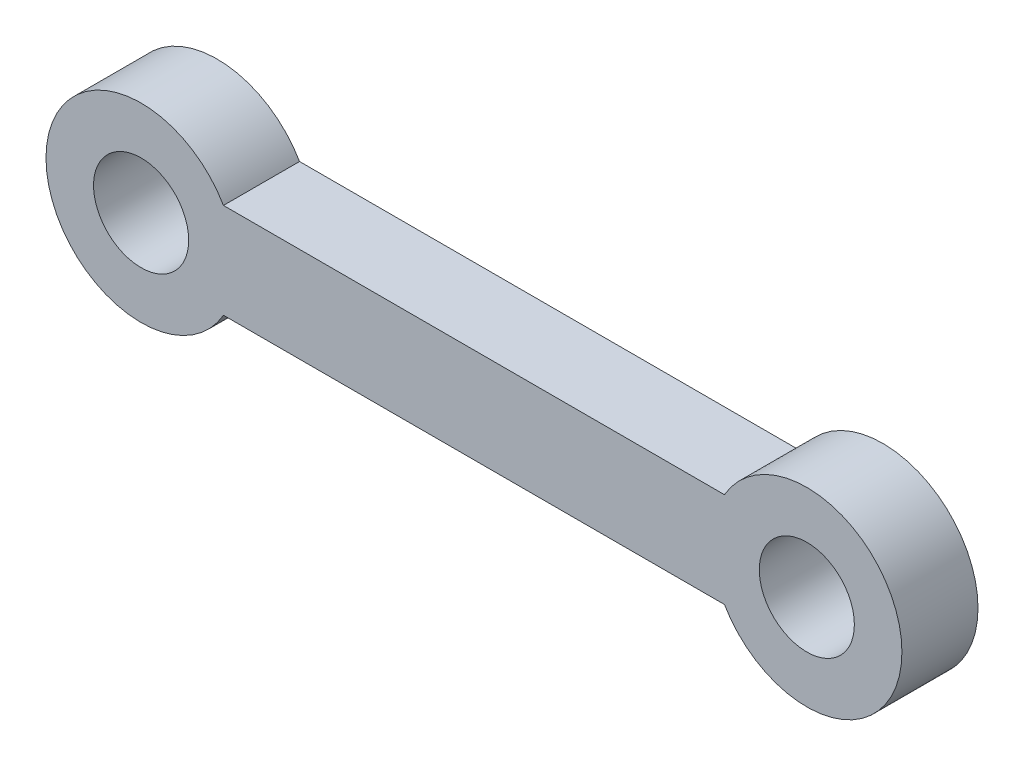
ISO-10303-21;
HEADER;
FILE_DESCRIPTION(('STEP AP214'),'2;1');
FILE_NAME('part.step','',(''),(''),'','','');
FILE_SCHEMA(('AUTOMOTIVE_DESIGN { 1 0 10303 214 1 1 1 1 }'));
ENDSEC;
DATA;
#1=APPLICATION_CONTEXT('core data for automotive mechanical design processes');
#2=APPLICATION_PROTOCOL_DEFINITION('international standard','automotive_design',2000,#1);
#3=PRODUCT_CONTEXT('',#1,'mechanical');
#4=PRODUCT('Part','Part','',(#3));
#5=PRODUCT_RELATED_PRODUCT_CATEGORY('part','',(#4));
#6=PRODUCT_DEFINITION_FORMATION('','',#4);
#7=PRODUCT_DEFINITION_CONTEXT('part definition',#1,'design');
#8=PRODUCT_DEFINITION('design','',#6,#7);
#9=PRODUCT_DEFINITION_SHAPE('','',#8);
#10=(LENGTH_UNIT() NAMED_UNIT(*) SI_UNIT(.MILLI.,.METRE.));
#11=(NAMED_UNIT(*) PLANE_ANGLE_UNIT() SI_UNIT($,.RADIAN.));
#12=(NAMED_UNIT(*) SI_UNIT($,.STERADIAN.) SOLID_ANGLE_UNIT());
#13=UNCERTAINTY_MEASURE_WITH_UNIT(LENGTH_MEASURE(1.E-05),#10,'distance_accuracy_value','');
#14=(GEOMETRIC_REPRESENTATION_CONTEXT(3) GLOBAL_UNCERTAINTY_ASSIGNED_CONTEXT((#13)) GLOBAL_UNIT_ASSIGNED_CONTEXT((#10,
#11,#12)) REPRESENTATION_CONTEXT('',''));
#15=CARTESIAN_POINT('',(0.,0.,0.));
#16=DIRECTION('',(0.,0.,1.));
#17=DIRECTION('',(1.,0.,0.));
#18=AXIS2_PLACEMENT_3D('',#15,#16,#17);
#19=CARTESIAN_POINT('',(0.,-2.5,4.));
#20=DIRECTION('',(0.,1.,0.));
#21=DIRECTION('',(0.,0.,1.));
#22=AXIS2_PLACEMENT_3D('',#19,#20,#21);
#23=PLANE('',#22);
#24=DIRECTION('',(1.,0.,0.));
#25=VECTOR('',#24,1.);
#26=CARTESIAN_POINT('',(0.,-2.5,0.));
#27=LINE('',#26,#25);
#28=CARTESIAN_POINT('',(4.33012701892219,-2.5,0.));
#29=VERTEX_POINT('',#28);
#30=CARTESIAN_POINT('',(30.6698729810778,-2.5,0.));
#31=VERTEX_POINT('',#30);
#32=EDGE_CURVE('E104',#29,#31,#27,.T.);
#33=ORIENTED_EDGE('',*,*,#32,.T.);
#34=DIRECTION('',(0.,0.,-1.));
#35=VECTOR('',#34,1.);
#36=CARTESIAN_POINT('',(30.6698729810778,-2.5,4.));
#37=LINE('',#36,#35);
#38=CARTESIAN_POINT('',(30.6698729810778,-2.5,4.));
#39=VERTEX_POINT('',#38);
#40=EDGE_CURVE('E11',#39,#31,#37,.T.);
#41=ORIENTED_EDGE('',*,*,#40,.F.);
#42=DIRECTION('',(1.,0.,0.));
#43=VECTOR('',#42,1.);
#44=CARTESIAN_POINT('',(0.,-2.5,4.));
#45=LINE('',#44,#43);
#46=CARTESIAN_POINT('',(4.33012701892219,-2.5,4.));
#47=VERTEX_POINT('',#46);
#48=EDGE_CURVE('E83',#47,#39,#45,.T.);
#49=ORIENTED_EDGE('',*,*,#48,.F.);
#50=DIRECTION('',(0.,0.,-1.));
#51=VECTOR('',#50,1.);
#52=CARTESIAN_POINT('',(4.33012701892219,-2.5,4.));
#53=LINE('',#52,#51);
#54=EDGE_CURVE('E103',#47,#29,#53,.T.);
#55=ORIENTED_EDGE('',*,*,#54,.T.);
#56=EDGE_LOOP('',(#33,#41,#49,#55));
#57=FACE_BOUND('',#56,.T.);
#58=ADVANCED_FACE('F35',(#57),#23,.F.);
#59=CARTESIAN_POINT('',(35.,0.,4.));
#60=DIRECTION('',(0.,0.,-1.));
#61=DIRECTION('',(-1.,0.,0.));
#62=AXIS2_PLACEMENT_3D('',#59,#60,#61);
#63=CYLINDRICAL_SURFACE('',#62,5.);
#64=CARTESIAN_POINT('',(35.,0.,0.));
#65=DIRECTION('',(0.,0.,1.));
#66=DIRECTION('',(1.,0.,0.));
#67=AXIS2_PLACEMENT_3D('',#64,#65,#66);
#68=CIRCLE('',#67,5.);
#69=CARTESIAN_POINT('',(30.6698729810778,2.5,0.));
#70=VERTEX_POINT('',#69);
#71=EDGE_CURVE('E88',#31,#70,#68,.T.);
#72=ORIENTED_EDGE('',*,*,#71,.T.);
#73=DIRECTION('',(0.,0.,-1.));
#74=VECTOR('',#73,1.);
#75=CARTESIAN_POINT('',(30.6698729810778,2.5,4.));
#76=LINE('',#75,#74);
#77=CARTESIAN_POINT('',(30.6698729810778,2.5,4.));
#78=VERTEX_POINT('',#77);
#79=EDGE_CURVE('E43',#78,#70,#76,.T.);
#80=ORIENTED_EDGE('',*,*,#79,.F.);
#81=CARTESIAN_POINT('',(35.,0.,4.));
#82=DIRECTION('',(0.,0.,1.));
#83=DIRECTION('',(1.,0.,0.));
#84=AXIS2_PLACEMENT_3D('',#81,#82,#83);
#85=CIRCLE('',#84,5.);
#86=EDGE_CURVE('E77',#39,#78,#85,.T.);
#87=ORIENTED_EDGE('',*,*,#86,.F.);
#88=ORIENTED_EDGE('',*,*,#40,.T.);
#89=EDGE_LOOP('',(#72,#80,#87,#88));
#90=FACE_BOUND('',#89,.T.);
#91=ADVANCED_FACE('F87',(#90),#63,.T.);
#92=CARTESIAN_POINT('',(0.,2.5,4.));
#93=DIRECTION('',(0.,1.,0.));
#94=DIRECTION('',(0.,0.,1.));
#95=AXIS2_PLACEMENT_3D('',#92,#93,#94);
#96=PLANE('',#95);
#97=DIRECTION('',(1.,0.,0.));
#98=VECTOR('',#97,1.);
#99=CARTESIAN_POINT('',(0.,2.5,0.));
#100=LINE('',#99,#98);
#101=CARTESIAN_POINT('',(4.33012701892219,2.5,0.));
#102=VERTEX_POINT('',#101);
#103=EDGE_CURVE('E108',#102,#70,#100,.T.);
#104=ORIENTED_EDGE('',*,*,#103,.F.);
#105=DIRECTION('',(0.,0.,-1.));
#106=VECTOR('',#105,1.);
#107=CARTESIAN_POINT('',(4.33012701892219,2.5,4.));
#108=LINE('',#107,#106);
#109=CARTESIAN_POINT('',(4.33012701892219,2.5,4.));
#110=VERTEX_POINT('',#109);
#111=EDGE_CURVE('E67',#110,#102,#108,.T.);
#112=ORIENTED_EDGE('',*,*,#111,.F.);
#113=DIRECTION('',(1.,0.,0.));
#114=VECTOR('',#113,1.);
#115=CARTESIAN_POINT('',(0.,2.5,4.));
#116=LINE('',#115,#114);
#117=EDGE_CURVE('E81',#110,#78,#116,.T.);
#118=ORIENTED_EDGE('',*,*,#117,.T.);
#119=ORIENTED_EDGE('',*,*,#79,.T.);
#120=EDGE_LOOP('',(#104,#112,#118,#119));
#121=FACE_BOUND('',#120,.T.);
#122=ADVANCED_FACE('F92',(#121),#96,.T.);
#123=CARTESIAN_POINT('',(0.,0.,4.));
#124=DIRECTION('',(0.,0.,-1.));
#125=DIRECTION('',(-1.,0.,0.));
#126=AXIS2_PLACEMENT_3D('',#123,#124,#125);
#127=CYLINDRICAL_SURFACE('',#126,2.5);
#128=CARTESIAN_POINT('',(0.,0.,4.));
#129=DIRECTION('',(0.,0.,1.));
#130=DIRECTION('',(1.,0.,0.));
#131=AXIS2_PLACEMENT_3D('',#128,#129,#130);
#132=CIRCLE('',#131,2.5);
#133=CARTESIAN_POINT('',(2.5,0.,4.));
#134=VERTEX_POINT('',#133);
#135=EDGE_CURVE('E94',#134,#134,#132,.T.);
#136=ORIENTED_EDGE('',*,*,#135,.T.);
#137=EDGE_LOOP('',(#136));
#138=FACE_BOUND('',#137,.T.);
#139=CARTESIAN_POINT('',(0.,0.,0.));
#140=DIRECTION('',(0.,0.,1.));
#141=DIRECTION('',(1.,0.,0.));
#142=AXIS2_PLACEMENT_3D('',#139,#140,#141);
#143=CIRCLE('',#142,2.5);
#144=CARTESIAN_POINT('',(2.5,0.,0.));
#145=VERTEX_POINT('',#144);
#146=EDGE_CURVE('E111',#145,#145,#143,.T.);
#147=ORIENTED_EDGE('',*,*,#146,.F.);
#148=EDGE_LOOP('',(#147));
#149=FACE_BOUND('',#148,.T.);
#150=ADVANCED_FACE('F139',(#138,#149),#127,.F.);
#151=CARTESIAN_POINT('',(0.,0.,4.));
#152=DIRECTION('',(0.,0.,-1.));
#153=DIRECTION('',(-1.,0.,0.));
#154=AXIS2_PLACEMENT_3D('',#151,#152,#153);
#155=CYLINDRICAL_SURFACE('',#154,5.);
#156=CARTESIAN_POINT('',(0.,0.,0.));
#157=DIRECTION('',(0.,0.,1.));
#158=DIRECTION('',(1.,0.,0.));
#159=AXIS2_PLACEMENT_3D('',#156,#157,#158);
#160=CIRCLE('',#159,5.);
#161=EDGE_CURVE('E70',#102,#29,#160,.T.);
#162=ORIENTED_EDGE('',*,*,#161,.T.);
#163=ORIENTED_EDGE('',*,*,#54,.F.);
#164=CARTESIAN_POINT('',(0.,0.,4.));
#165=DIRECTION('',(0.,0.,1.));
#166=DIRECTION('',(1.,0.,0.));
#167=AXIS2_PLACEMENT_3D('',#164,#165,#166);
#168=CIRCLE('',#167,5.);
#169=EDGE_CURVE('E51',#110,#47,#168,.T.);
#170=ORIENTED_EDGE('',*,*,#169,.F.);
#171=ORIENTED_EDGE('',*,*,#111,.T.);
#172=EDGE_LOOP('',(#162,#163,#170,#171));
#173=FACE_BOUND('',#172,.T.);
#174=ADVANCED_FACE('F131',(#173),#155,.T.);
#175=CARTESIAN_POINT('',(35.,0.,4.));
#176=DIRECTION('',(0.,0.,-1.));
#177=DIRECTION('',(-1.,0.,0.));
#178=AXIS2_PLACEMENT_3D('',#175,#176,#177);
#179=CYLINDRICAL_SURFACE('',#178,2.5);
#180=CARTESIAN_POINT('',(35.,0.,4.));
#181=DIRECTION('',(0.,0.,1.));
#182=DIRECTION('',(1.,0.,0.));
#183=AXIS2_PLACEMENT_3D('',#180,#181,#182);
#184=CIRCLE('',#183,2.5);
#185=CARTESIAN_POINT('',(37.5,0.,4.));
#186=VERTEX_POINT('',#185);
#187=EDGE_CURVE('E100',#186,#186,#184,.T.);
#188=ORIENTED_EDGE('',*,*,#187,.T.);
#189=EDGE_LOOP('',(#188));
#190=FACE_BOUND('',#189,.T.);
#191=CARTESIAN_POINT('',(35.,0.,0.));
#192=DIRECTION('',(0.,0.,1.));
#193=DIRECTION('',(1.,0.,0.));
#194=AXIS2_PLACEMENT_3D('',#191,#192,#193);
#195=CIRCLE('',#194,2.5);
#196=CARTESIAN_POINT('',(37.5,0.,0.));
#197=VERTEX_POINT('',#196);
#198=EDGE_CURVE('E114',#197,#197,#195,.T.);
#199=ORIENTED_EDGE('',*,*,#198,.F.);
#200=EDGE_LOOP('',(#199));
#201=FACE_BOUND('',#200,.T.);
#202=ADVANCED_FACE('F129',(#190,#201),#179,.F.);
#203=CARTESIAN_POINT('',(0.,0.,4.));
#204=DIRECTION('',(0.,0.,1.));
#205=DIRECTION('',(1.,0.,0.));
#206=AXIS2_PLACEMENT_3D('',#203,#204,#205);
#207=PLANE('',#206);
#208=ORIENTED_EDGE('',*,*,#48,.T.);
#209=ORIENTED_EDGE('',*,*,#86,.T.);
#210=ORIENTED_EDGE('',*,*,#117,.F.);
#211=ORIENTED_EDGE('',*,*,#169,.T.);
#212=EDGE_LOOP('',(#208,#209,#210,#211));
#213=FACE_BOUND('',#212,.T.);
#214=ORIENTED_EDGE('',*,*,#135,.F.);
#215=EDGE_LOOP('',(#214));
#216=FACE_BOUND('',#215,.T.);
#217=ORIENTED_EDGE('',*,*,#187,.F.);
#218=EDGE_LOOP('',(#217));
#219=FACE_BOUND('',#218,.T.);
#220=ADVANCED_FACE('F78',(#213,#216,#219),#207,.T.);
#221=CARTESIAN_POINT('',(0.,0.,0.));
#222=DIRECTION('',(0.,0.,1.));
#223=DIRECTION('',(1.,0.,0.));
#224=AXIS2_PLACEMENT_3D('',#221,#222,#223);
#225=PLANE('',#224);
#226=ORIENTED_EDGE('',*,*,#32,.F.);
#227=ORIENTED_EDGE('',*,*,#161,.F.);
#228=ORIENTED_EDGE('',*,*,#103,.T.);
#229=ORIENTED_EDGE('',*,*,#71,.F.);
#230=EDGE_LOOP('',(#226,#227,#228,#229));
#231=FACE_BOUND('',#230,.T.);
#232=ORIENTED_EDGE('',*,*,#146,.T.);
#233=EDGE_LOOP('',(#232));
#234=FACE_BOUND('',#233,.T.);
#235=ORIENTED_EDGE('',*,*,#198,.T.);
#236=EDGE_LOOP('',(#235));
#237=FACE_BOUND('',#236,.T.);
#238=ADVANCED_FACE('F121',(#231,#234,#237),#225,.F.);
#239=CLOSED_SHELL('',(#58,#91,#122,#150,#174,#202,#220,#238));
#240=MANIFOLD_SOLID_BREP('B2',#239);
#241=ADVANCED_BREP_SHAPE_REPRESENTATION('',(#18,#240),#14);
#242=SHAPE_DEFINITION_REPRESENTATION(#9,#241);
ENDSEC;
END-ISO-10303-21;
